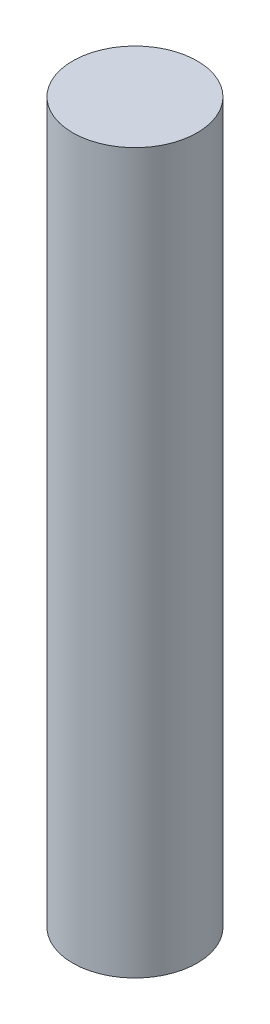
ISO-10303-21;
HEADER;
FILE_DESCRIPTION(('STEP AP214'),'2;1');
FILE_NAME('part.step','',(''),(''),'','','');
FILE_SCHEMA(('AUTOMOTIVE_DESIGN { 1 0 10303 214 1 1 1 1 }'));
ENDSEC;
DATA;
#1=APPLICATION_CONTEXT('core data for automotive mechanical design processes');
#2=APPLICATION_PROTOCOL_DEFINITION('international standard','automotive_design',2000,#1);
#3=PRODUCT_CONTEXT('',#1,'mechanical');
#4=PRODUCT('Part','Part','',(#3));
#5=PRODUCT_RELATED_PRODUCT_CATEGORY('part','',(#4));
#6=PRODUCT_DEFINITION_FORMATION('','',#4);
#7=PRODUCT_DEFINITION_CONTEXT('part definition',#1,'design');
#8=PRODUCT_DEFINITION('design','',#6,#7);
#9=PRODUCT_DEFINITION_SHAPE('','',#8);
#10=(LENGTH_UNIT() NAMED_UNIT(*) SI_UNIT(.MILLI.,.METRE.));
#11=(NAMED_UNIT(*) PLANE_ANGLE_UNIT() SI_UNIT($,.RADIAN.));
#12=(NAMED_UNIT(*) SI_UNIT($,.STERADIAN.) SOLID_ANGLE_UNIT());
#13=UNCERTAINTY_MEASURE_WITH_UNIT(LENGTH_MEASURE(1.E-05),#10,'distance_accuracy_value','');
#14=(GEOMETRIC_REPRESENTATION_CONTEXT(3) GLOBAL_UNCERTAINTY_ASSIGNED_CONTEXT((#13)) GLOBAL_UNIT_ASSIGNED_CONTEXT((#10,
#11,#12)) REPRESENTATION_CONTEXT('',''));
#15=CARTESIAN_POINT('',(0.,0.,0.));
#16=DIRECTION('',(0.,0.,1.));
#17=DIRECTION('',(1.,0.,0.));
#18=AXIS2_PLACEMENT_3D('',#15,#16,#17);
#19=CARTESIAN_POINT('',(0.,11.55,0.));
#20=DIRECTION('',(0.,-1.,0.));
#21=DIRECTION('',(0.,0.,-1.));
#22=AXIS2_PLACEMENT_3D('',#19,#20,#21);
#23=CYLINDRICAL_SURFACE('',#22,2.);
#24=CARTESIAN_POINT('',(0.,11.55,0.));
#25=DIRECTION('',(0.,1.,0.));
#26=DIRECTION('',(0.,0.,1.));
#27=AXIS2_PLACEMENT_3D('',#24,#25,#26);
#28=CIRCLE('',#27,2.);
#29=CARTESIAN_POINT('',(0.,11.55,2.));
#30=VERTEX_POINT('',#29);
#31=EDGE_CURVE('E10',#30,#30,#28,.T.);
#32=ORIENTED_EDGE('',*,*,#31,.F.);
#33=EDGE_LOOP('',(#32));
#34=FACE_BOUND('',#33,.T.);
#35=CARTESIAN_POINT('',(0.,-11.55,0.));
#36=DIRECTION('',(0.,1.,0.));
#37=DIRECTION('',(0.,0.,1.));
#38=AXIS2_PLACEMENT_3D('',#35,#36,#37);
#39=CIRCLE('',#38,2.);
#40=CARTESIAN_POINT('',(0.,-11.55,2.));
#41=VERTEX_POINT('',#40);
#42=EDGE_CURVE('E40',#41,#41,#39,.T.);
#43=ORIENTED_EDGE('',*,*,#42,.T.);
#44=EDGE_LOOP('',(#43));
#45=FACE_BOUND('',#44,.T.);
#46=ADVANCED_FACE('F37',(#34,#45),#23,.T.);
#47=CARTESIAN_POINT('',(0.,11.55,0.));
#48=DIRECTION('',(0.,1.,0.));
#49=DIRECTION('',(0.,0.,1.));
#50=AXIS2_PLACEMENT_3D('',#47,#48,#49);
#51=PLANE('',#50);
#52=ORIENTED_EDGE('',*,*,#31,.T.);
#53=EDGE_LOOP('',(#52));
#54=FACE_BOUND('',#53,.T.);
#55=ADVANCED_FACE('F54',(#54),#51,.T.);
#56=CARTESIAN_POINT('',(0.,-11.55,0.));
#57=DIRECTION('',(0.,1.,0.));
#58=DIRECTION('',(0.,0.,1.));
#59=AXIS2_PLACEMENT_3D('',#56,#57,#58);
#60=PLANE('',#59);
#61=ORIENTED_EDGE('',*,*,#42,.F.);
#62=EDGE_LOOP('',(#61));
#63=FACE_BOUND('',#62,.T.);
#64=ADVANCED_FACE('F52',(#63),#60,.F.);
#65=CLOSED_SHELL('',(#46,#55,#64));
#66=MANIFOLD_SOLID_BREP('B2',#65);
#67=ADVANCED_BREP_SHAPE_REPRESENTATION('',(#18,#66),#14);
#68=SHAPE_DEFINITION_REPRESENTATION(#9,#67);
ENDSEC;
END-ISO-10303-21;
